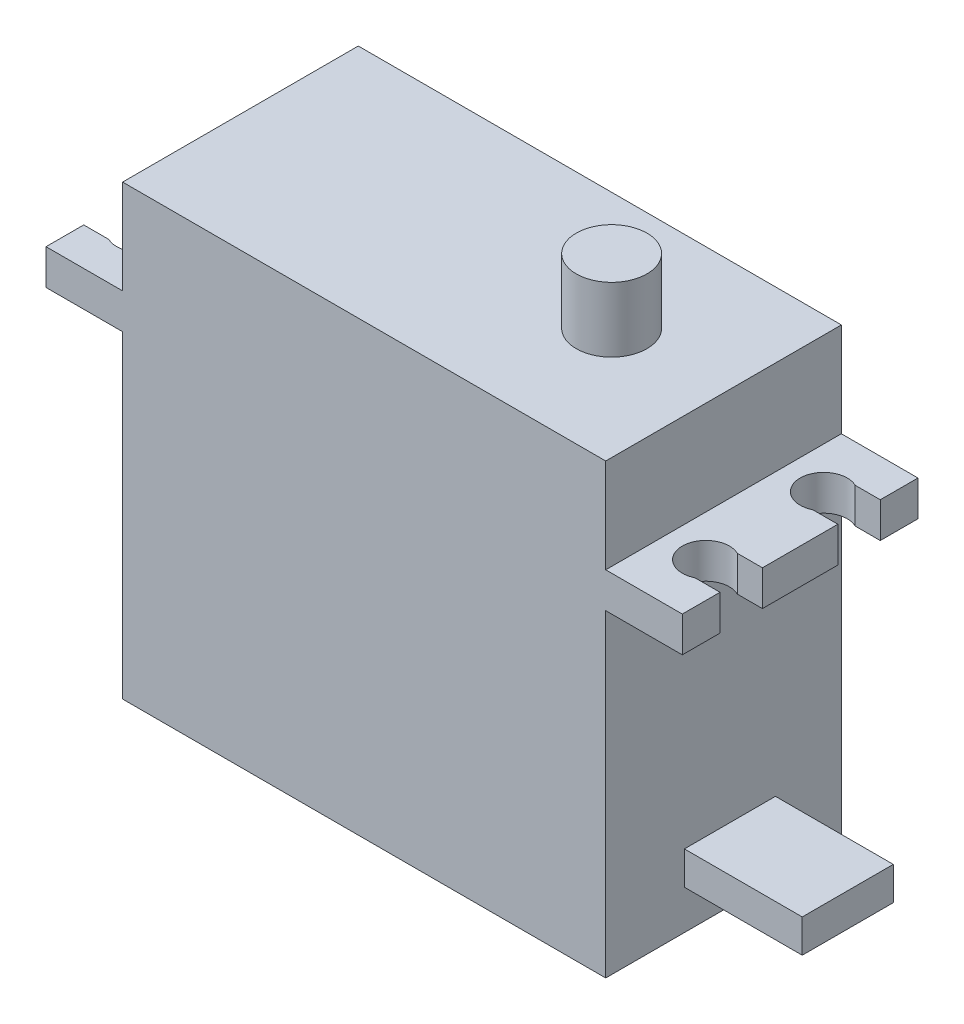
ISO-10303-21;
HEADER;
FILE_DESCRIPTION(('STEP AP214'),'2;1');
FILE_NAME('part.step','',(''),(''),'','','');
FILE_SCHEMA(('AUTOMOTIVE_DESIGN { 1 0 10303 214 1 1 1 1 }'));
ENDSEC;
DATA;
#1=APPLICATION_CONTEXT('core data for automotive mechanical design processes');
#2=APPLICATION_PROTOCOL_DEFINITION('international standard','automotive_design',2000,#1);
#3=PRODUCT_CONTEXT('',#1,'mechanical');
#4=PRODUCT('Part','Part','',(#3));
#5=PRODUCT_RELATED_PRODUCT_CATEGORY('part','',(#4));
#6=PRODUCT_DEFINITION_FORMATION('','',#4);
#7=PRODUCT_DEFINITION_CONTEXT('part definition',#1,'design');
#8=PRODUCT_DEFINITION('design','',#6,#7);
#9=PRODUCT_DEFINITION_SHAPE('','',#8);
#10=(LENGTH_UNIT() NAMED_UNIT(*) SI_UNIT(.MILLI.,.METRE.));
#11=(NAMED_UNIT(*) PLANE_ANGLE_UNIT() SI_UNIT($,.RADIAN.));
#12=(NAMED_UNIT(*) SI_UNIT($,.STERADIAN.) SOLID_ANGLE_UNIT());
#13=UNCERTAINTY_MEASURE_WITH_UNIT(LENGTH_MEASURE(1.E-05),#10,'distance_accuracy_value','');
#14=(GEOMETRIC_REPRESENTATION_CONTEXT(3) GLOBAL_UNCERTAINTY_ASSIGNED_CONTEXT((#13)) GLOBAL_UNIT_ASSIGNED_CONTEXT((#10,
#11,#12)) REPRESENTATION_CONTEXT('',''));
#15=CARTESIAN_POINT('',(0.,0.,0.));
#16=DIRECTION('',(0.,0.,1.));
#17=DIRECTION('',(1.,0.,0.));
#18=AXIS2_PLACEMENT_3D('',#15,#16,#17);
#19=CARTESIAN_POINT('',(20.5,38.,-10.));
#20=DIRECTION('',(-1.,0.,0.));
#21=DIRECTION('',(0.,0.,1.));
#22=AXIS2_PLACEMENT_3D('',#19,#20,#21);
#23=PLANE('',#22);
#24=DIRECTION('',(0.,-1.,0.));
#25=VECTOR('',#24,1.);
#26=CARTESIAN_POINT('',(20.5,38.,-10.));
#27=LINE('',#26,#25);
#28=CARTESIAN_POINT('',(20.5,27.,-10.));
#29=VERTEX_POINT('',#28);
#30=CARTESIAN_POINT('',(20.5,0.,-10.));
#31=VERTEX_POINT('',#30);
#32=EDGE_CURVE('E460',#29,#31,#27,.T.);
#33=ORIENTED_EDGE('',*,*,#32,.F.);
#34=DIRECTION('',(0.,0.,1.));
#35=VECTOR('',#34,1.);
#36=CARTESIAN_POINT('',(20.5,27.,-10.));
#37=LINE('',#36,#35);
#38=CARTESIAN_POINT('',(20.5,27.,10.));
#39=VERTEX_POINT('',#38);
#40=EDGE_CURVE('E425',#29,#39,#37,.T.);
#41=ORIENTED_EDGE('',*,*,#40,.T.);
#42=DIRECTION('',(0.,-1.,0.));
#43=VECTOR('',#42,1.);
#44=CARTESIAN_POINT('',(20.5,38.,10.));
#45=LINE('',#44,#43);
#46=CARTESIAN_POINT('',(20.5,0.,10.));
#47=VERTEX_POINT('',#46);
#48=EDGE_CURVE('E463',#39,#47,#45,.T.);
#49=ORIENTED_EDGE('',*,*,#48,.T.);
#50=DIRECTION('',(0.,0.,-1.));
#51=VECTOR('',#50,1.);
#52=CARTESIAN_POINT('',(20.5,0.,-10.));
#53=LINE('',#52,#51);
#54=EDGE_CURVE('E452',#47,#31,#53,.T.);
#55=ORIENTED_EDGE('',*,*,#54,.T.);
#56=EDGE_LOOP('',(#33,#41,#49,#55));
#57=FACE_BOUND('',#56,.T.);
#58=DIRECTION('',(0.,-1.,0.));
#59=VECTOR('',#58,1.);
#60=CARTESIAN_POINT('',(20.5,6.14900219854572,3.32183324877389));
#61=LINE('',#60,#59);
#62=CARTESIAN_POINT('',(20.5,6.14900219854572,3.32183324877389));
#63=VERTEX_POINT('',#62);
#64=CARTESIAN_POINT('',(20.5,3.33266531371568,3.32183324877389));
#65=VERTEX_POINT('',#64);
#66=EDGE_CURVE('E263',#63,#65,#61,.T.);
#67=ORIENTED_EDGE('',*,*,#66,.F.);
#68=DIRECTION('',(0.,0.,1.));
#69=VECTOR('',#68,1.);
#70=CARTESIAN_POINT('',(20.5,6.14900219854572,3.32183324877389));
#71=LINE('',#70,#69);
#72=CARTESIAN_POINT('',(20.5,6.14900219854572,-4.40503974293929));
#73=VERTEX_POINT('',#72);
#74=EDGE_CURVE('E260',#73,#63,#71,.T.);
#75=ORIENTED_EDGE('',*,*,#74,.F.);
#76=DIRECTION('',(0.,1.,0.));
#77=VECTOR('',#76,1.);
#78=CARTESIAN_POINT('',(20.5,6.14900219854572,-4.40503974293929));
#79=LINE('',#78,#77);
#80=CARTESIAN_POINT('',(20.5,3.33266531371569,-4.40503974293929));
#81=VERTEX_POINT('',#80);
#82=EDGE_CURVE('E54',#81,#73,#79,.T.);
#83=ORIENTED_EDGE('',*,*,#82,.F.);
#84=DIRECTION('',(0.,0.,-1.));
#85=VECTOR('',#84,1.);
#86=CARTESIAN_POINT('',(20.5,3.33266531371569,3.32183324877389));
#87=LINE('',#86,#85);
#88=EDGE_CURVE('E49',#65,#81,#87,.T.);
#89=ORIENTED_EDGE('',*,*,#88,.F.);
#90=EDGE_LOOP('',(#67,#75,#83,#89));
#91=FACE_BOUND('',#90,.T.);
#92=ADVANCED_FACE('F34',(#57,#91),#23,.F.);
#93=CARTESIAN_POINT('',(-20.5,38.,10.));
#94=DIRECTION('',(0.,1.,0.));
#95=DIRECTION('',(0.,0.,1.));
#96=AXIS2_PLACEMENT_3D('',#93,#94,#95);
#97=PLANE('',#96);
#98=DIRECTION('',(0.,0.,1.));
#99=VECTOR('',#98,1.);
#100=CARTESIAN_POINT('',(-20.5,38.,-10.));
#101=LINE('',#100,#99);
#102=CARTESIAN_POINT('',(-20.5,38.,-10.));
#103=VERTEX_POINT('',#102);
#104=CARTESIAN_POINT('',(-20.5,38.,10.));
#105=VERTEX_POINT('',#104);
#106=EDGE_CURVE('E436',#103,#105,#101,.T.);
#107=ORIENTED_EDGE('',*,*,#106,.T.);
#108=DIRECTION('',(1.,0.,0.));
#109=VECTOR('',#108,1.);
#110=CARTESIAN_POINT('',(-20.5,38.,10.));
#111=LINE('',#110,#109);
#112=CARTESIAN_POINT('',(20.5,38.,10.));
#113=VERTEX_POINT('',#112);
#114=EDGE_CURVE('E439',#105,#113,#111,.T.);
#115=ORIENTED_EDGE('',*,*,#114,.T.);
#116=DIRECTION('',(0.,0.,-1.));
#117=VECTOR('',#116,1.);
#118=CARTESIAN_POINT('',(20.5,38.,-10.));
#119=LINE('',#118,#117);
#120=CARTESIAN_POINT('',(20.5,38.,-10.));
#121=VERTEX_POINT('',#120);
#122=EDGE_CURVE('E442',#113,#121,#119,.T.);
#123=ORIENTED_EDGE('',*,*,#122,.T.);
#124=DIRECTION('',(-1.,0.,0.));
#125=VECTOR('',#124,1.);
#126=CARTESIAN_POINT('',(-20.5,38.,-10.));
#127=LINE('',#126,#125);
#128=EDGE_CURVE('E444',#121,#103,#127,.T.);
#129=ORIENTED_EDGE('',*,*,#128,.T.);
#130=EDGE_LOOP('',(#107,#115,#123,#129));
#131=FACE_BOUND('',#130,.T.);
#132=CARTESIAN_POINT('',(11.,38.,0.));
#133=DIRECTION('',(0.,1.,0.));
#134=DIRECTION('',(0.,0.,1.));
#135=AXIS2_PLACEMENT_3D('',#132,#133,#134);
#136=CIRCLE('',#135,3.);
#137=CARTESIAN_POINT('',(11.,38.,3.));
#138=VERTEX_POINT('',#137);
#139=EDGE_CURVE('E264',#138,#138,#136,.T.);
#140=ORIENTED_EDGE('',*,*,#139,.F.);
#141=EDGE_LOOP('',(#140));
#142=FACE_BOUND('',#141,.T.);
#143=ADVANCED_FACE('F506',(#131,#142),#97,.T.);
#144=CARTESIAN_POINT('',(-27.,30.,-10.));
#145=DIRECTION('',(1.,0.,0.));
#146=DIRECTION('',(0.,0.,-1.));
#147=AXIS2_PLACEMENT_3D('',#144,#145,#146);
#148=PLANE('',#147);
#149=DIRECTION('',(0.,0.,1.));
#150=VECTOR('',#149,1.);
#151=CARTESIAN_POINT('',(-27.,27.,-10.));
#152=LINE('',#151,#150);
#153=CARTESIAN_POINT('',(-27.,27.,-3.2));
#154=VERTEX_POINT('',#153);
#155=CARTESIAN_POINT('',(-27.,27.,3.2));
#156=VERTEX_POINT('',#155);
#157=EDGE_CURVE('E410',#154,#156,#152,.T.);
#158=ORIENTED_EDGE('',*,*,#157,.T.);
#159=DIRECTION('',(0.,1.,0.));
#160=VECTOR('',#159,1.);
#161=CARTESIAN_POINT('',(-27.,-0.001000000000001,3.2));
#162=LINE('',#161,#160);
#163=CARTESIAN_POINT('',(-27.,30.,3.2));
#164=VERTEX_POINT('',#163);
#165=EDGE_CURVE('E290',#156,#164,#162,.T.);
#166=ORIENTED_EDGE('',*,*,#165,.T.);
#167=DIRECTION('',(0.,0.,1.));
#168=VECTOR('',#167,1.);
#169=CARTESIAN_POINT('',(-27.,30.,-10.));
#170=LINE('',#169,#168);
#171=CARTESIAN_POINT('',(-27.,30.,-3.2));
#172=VERTEX_POINT('',#171);
#173=EDGE_CURVE('E393',#172,#164,#170,.T.);
#174=ORIENTED_EDGE('',*,*,#173,.F.);
#175=DIRECTION('',(0.,1.,0.));
#176=VECTOR('',#175,1.);
#177=CARTESIAN_POINT('',(-27.,-0.001000000000001,-3.2));
#178=LINE('',#177,#176);
#179=EDGE_CURVE('E319',#154,#172,#178,.T.);
#180=ORIENTED_EDGE('',*,*,#179,.F.);
#181=EDGE_LOOP('',(#158,#166,#174,#180));
#182=FACE_BOUND('',#181,.T.);
#183=ADVANCED_FACE('F533',(#182),#148,.F.);
#184=CARTESIAN_POINT('',(-27.,30.,6.80000000000001));
#185=VERTEX_POINT('',#184);
#186=CARTESIAN_POINT('',(-27.,30.,10.));
#187=VERTEX_POINT('',#186);
#188=EDGE_CURVE('E388',#185,#187,#170,.T.);
#189=ORIENTED_EDGE('',*,*,#188,.F.);
#190=DIRECTION('',(0.,1.,0.));
#191=VECTOR('',#190,1.);
#192=CARTESIAN_POINT('',(-27.,-0.001000000000001,6.80000000000001));
#193=LINE('',#192,#191);
#194=CARTESIAN_POINT('',(-27.,27.,6.80000000000001));
#195=VERTEX_POINT('',#194);
#196=EDGE_CURVE('E289',#195,#185,#193,.T.);
#197=ORIENTED_EDGE('',*,*,#196,.F.);
#198=CARTESIAN_POINT('',(-27.,27.,10.));
#199=VERTEX_POINT('',#198);
#200=EDGE_CURVE('E405',#195,#199,#152,.T.);
#201=ORIENTED_EDGE('',*,*,#200,.T.);
#202=DIRECTION('',(0.,-1.,0.));
#203=VECTOR('',#202,1.);
#204=CARTESIAN_POINT('',(-27.,30.,10.));
#205=LINE('',#204,#203);
#206=EDGE_CURVE('E416',#187,#199,#205,.T.);
#207=ORIENTED_EDGE('',*,*,#206,.F.);
#208=EDGE_LOOP('',(#189,#197,#201,#207));
#209=FACE_BOUND('',#208,.T.);
#210=ADVANCED_FACE('F526',(#209),#148,.F.);
#211=CARTESIAN_POINT('',(27.,30.,-10.));
#212=DIRECTION('',(-1.,0.,0.));
#213=DIRECTION('',(0.,0.,1.));
#214=AXIS2_PLACEMENT_3D('',#211,#212,#213);
#215=PLANE('',#214);
#216=DIRECTION('',(0.,0.,-1.));
#217=VECTOR('',#216,1.);
#218=CARTESIAN_POINT('',(27.,30.,-10.));
#219=LINE('',#218,#217);
#220=CARTESIAN_POINT('',(27.,30.,-6.8));
#221=VERTEX_POINT('',#220);
#222=CARTESIAN_POINT('',(27.,30.,-10.));
#223=VERTEX_POINT('',#222);
#224=EDGE_CURVE('E385',#221,#223,#219,.T.);
#225=ORIENTED_EDGE('',*,*,#224,.F.);
#226=DIRECTION('',(0.,1.,0.));
#227=VECTOR('',#226,1.);
#228=CARTESIAN_POINT('',(27.,-0.001000000000001,-6.8));
#229=LINE('',#228,#227);
#230=CARTESIAN_POINT('',(27.,27.,-6.8));
#231=VERTEX_POINT('',#230);
#232=EDGE_CURVE('E344',#231,#221,#229,.T.);
#233=ORIENTED_EDGE('',*,*,#232,.F.);
#234=DIRECTION('',(0.,0.,-1.));
#235=VECTOR('',#234,1.);
#236=CARTESIAN_POINT('',(27.,27.,-10.));
#237=LINE('',#236,#235);
#238=CARTESIAN_POINT('',(27.,27.,-10.));
#239=VERTEX_POINT('',#238);
#240=EDGE_CURVE('E379',#231,#239,#237,.T.);
#241=ORIENTED_EDGE('',*,*,#240,.T.);
#242=DIRECTION('',(0.,-1.,0.));
#243=VECTOR('',#242,1.);
#244=CARTESIAN_POINT('',(27.,30.,-10.));
#245=LINE('',#244,#243);
#246=EDGE_CURVE('E422',#223,#239,#245,.T.);
#247=ORIENTED_EDGE('',*,*,#246,.F.);
#248=EDGE_LOOP('',(#225,#233,#241,#247));
#249=FACE_BOUND('',#248,.T.);
#250=ADVANCED_FACE('F580',(#249),#215,.F.);
#251=CARTESIAN_POINT('',(27.,27.,10.));
#252=VERTEX_POINT('',#251);
#253=CARTESIAN_POINT('',(27.,27.,6.8));
#254=VERTEX_POINT('',#253);
#255=EDGE_CURVE('E397',#252,#254,#237,.T.);
#256=ORIENTED_EDGE('',*,*,#255,.T.);
#257=DIRECTION('',(0.,1.,0.));
#258=VECTOR('',#257,1.);
#259=CARTESIAN_POINT('',(27.,-0.001000000000001,6.8));
#260=LINE('',#259,#258);
#261=CARTESIAN_POINT('',(27.,30.,6.8));
#262=VERTEX_POINT('',#261);
#263=EDGE_CURVE('E368',#254,#262,#260,.T.);
#264=ORIENTED_EDGE('',*,*,#263,.T.);
#265=CARTESIAN_POINT('',(27.,30.,10.));
#266=VERTEX_POINT('',#265);
#267=EDGE_CURVE('E380',#266,#262,#219,.T.);
#268=ORIENTED_EDGE('',*,*,#267,.F.);
#269=DIRECTION('',(0.,-1.,0.));
#270=VECTOR('',#269,1.);
#271=CARTESIAN_POINT('',(27.,30.,10.));
#272=LINE('',#271,#270);
#273=EDGE_CURVE('E396',#266,#252,#272,.T.);
#274=ORIENTED_EDGE('',*,*,#273,.T.);
#275=EDGE_LOOP('',(#256,#264,#268,#274));
#276=FACE_BOUND('',#275,.T.);
#277=ADVANCED_FACE('F496',(#276),#215,.F.);
#278=CARTESIAN_POINT('',(-20.5,38.,-10.));
#279=DIRECTION('',(1.,0.,0.));
#280=DIRECTION('',(0.,0.,-1.));
#281=AXIS2_PLACEMENT_3D('',#278,#279,#280);
#282=PLANE('',#281);
#283=DIRECTION('',(0.,0.,-1.));
#284=VECTOR('',#283,1.);
#285=CARTESIAN_POINT('',(-20.5,30.,-10.));
#286=LINE('',#285,#284);
#287=CARTESIAN_POINT('',(-20.5,30.,10.));
#288=VERTEX_POINT('',#287);
#289=CARTESIAN_POINT('',(-20.5,30.,-10.));
#290=VERTEX_POINT('',#289);
#291=EDGE_CURVE('E433',#288,#290,#286,.T.);
#292=ORIENTED_EDGE('',*,*,#291,.F.);
#293=DIRECTION('',(0.,-1.,0.));
#294=VECTOR('',#293,1.);
#295=CARTESIAN_POINT('',(-20.5,38.,10.));
#296=LINE('',#295,#294);
#297=EDGE_CURVE('E11',#105,#288,#296,.T.);
#298=ORIENTED_EDGE('',*,*,#297,.F.);
#299=ORIENTED_EDGE('',*,*,#106,.F.);
#300=DIRECTION('',(0.,-1.,0.));
#301=VECTOR('',#300,1.);
#302=CARTESIAN_POINT('',(-20.5,38.,-10.));
#303=LINE('',#302,#301);
#304=EDGE_CURVE('E457',#103,#290,#303,.T.);
#305=ORIENTED_EDGE('',*,*,#304,.T.);
#306=EDGE_LOOP('',(#292,#298,#299,#305));
#307=FACE_BOUND('',#306,.T.);
#308=ADVANCED_FACE('F513',(#307),#282,.F.);
#309=DIRECTION('',(0.,0.,1.));
#310=VECTOR('',#309,1.);
#311=CARTESIAN_POINT('',(20.5,30.,-10.));
#312=LINE('',#311,#310);
#313=CARTESIAN_POINT('',(20.5,30.,-10.));
#314=VERTEX_POINT('',#313);
#315=CARTESIAN_POINT('',(20.5,30.,10.));
#316=VERTEX_POINT('',#315);
#317=EDGE_CURVE('E431',#314,#316,#312,.T.);
#318=ORIENTED_EDGE('',*,*,#317,.F.);
#319=EDGE_CURVE('E461',#121,#314,#27,.T.);
#320=ORIENTED_EDGE('',*,*,#319,.F.);
#321=ORIENTED_EDGE('',*,*,#122,.F.);
#322=EDGE_CURVE('E464',#113,#316,#45,.T.);
#323=ORIENTED_EDGE('',*,*,#322,.T.);
#324=EDGE_LOOP('',(#318,#320,#321,#323));
#325=FACE_BOUND('',#324,.T.);
#326=ADVANCED_FACE('F503',(#325),#23,.F.);
#327=CARTESIAN_POINT('',(-20.5,27.,10.));
#328=VERTEX_POINT('',#327);
#329=CARTESIAN_POINT('',(-20.5,0.,10.));
#330=VERTEX_POINT('',#329);
#331=EDGE_CURVE('E42',#328,#330,#296,.T.);
#332=ORIENTED_EDGE('',*,*,#331,.F.);
#333=DIRECTION('',(0.,0.,-1.));
#334=VECTOR('',#333,1.);
#335=CARTESIAN_POINT('',(-20.5,27.,-10.));
#336=LINE('',#335,#334);
#337=CARTESIAN_POINT('',(-20.5,27.,-10.));
#338=VERTEX_POINT('',#337);
#339=EDGE_CURVE('E428',#328,#338,#336,.T.);
#340=ORIENTED_EDGE('',*,*,#339,.T.);
#341=CARTESIAN_POINT('',(-20.5,0.,-10.));
#342=VERTEX_POINT('',#341);
#343=EDGE_CURVE('E446',#338,#342,#303,.T.);
#344=ORIENTED_EDGE('',*,*,#343,.T.);
#345=DIRECTION('',(0.,0.,1.));
#346=VECTOR('',#345,1.);
#347=CARTESIAN_POINT('',(-20.5,0.,-10.));
#348=LINE('',#347,#346);
#349=EDGE_CURVE('E435',#342,#330,#348,.T.);
#350=ORIENTED_EDGE('',*,*,#349,.T.);
#351=EDGE_LOOP('',(#332,#340,#344,#350));
#352=FACE_BOUND('',#351,.T.);
#353=ADVANCED_FACE('F36',(#352),#282,.F.);
#354=CARTESIAN_POINT('',(-20.5,38.,10.));
#355=DIRECTION('',(0.,0.,-1.));
#356=DIRECTION('',(-1.,0.,0.));
#357=AXIS2_PLACEMENT_3D('',#354,#355,#356);
#358=PLANE('',#357);
#359=ORIENTED_EDGE('',*,*,#48,.F.);
#360=DIRECTION('',(1.,0.,0.));
#361=VECTOR('',#360,1.);
#362=CARTESIAN_POINT('',(27.,27.,10.));
#363=LINE('',#362,#361);
#364=EDGE_CURVE('E409',#39,#252,#363,.T.);
#365=ORIENTED_EDGE('',*,*,#364,.T.);
#366=ORIENTED_EDGE('',*,*,#273,.F.);
#367=DIRECTION('',(1.,0.,0.));
#368=VECTOR('',#367,1.);
#369=CARTESIAN_POINT('',(27.,30.,10.));
#370=LINE('',#369,#368);
#371=EDGE_CURVE('E392',#316,#266,#370,.T.);
#372=ORIENTED_EDGE('',*,*,#371,.F.);
#373=ORIENTED_EDGE('',*,*,#322,.F.);
#374=ORIENTED_EDGE('',*,*,#114,.F.);
#375=ORIENTED_EDGE('',*,*,#297,.T.);
#376=EDGE_CURVE('E394',#187,#288,#370,.T.);
#377=ORIENTED_EDGE('',*,*,#376,.F.);
#378=ORIENTED_EDGE('',*,*,#206,.T.);
#379=EDGE_CURVE('E411',#199,#328,#363,.T.);
#380=ORIENTED_EDGE('',*,*,#379,.T.);
#381=ORIENTED_EDGE('',*,*,#331,.T.);
#382=DIRECTION('',(1.,0.,0.));
#383=VECTOR('',#382,1.);
#384=CARTESIAN_POINT('',(-20.5,0.,10.));
#385=LINE('',#384,#383);
#386=EDGE_CURVE('E449',#330,#47,#385,.T.);
#387=ORIENTED_EDGE('',*,*,#386,.T.);
#388=EDGE_LOOP('',(#359,#365,#366,#372,#373,#374,#375,#377,#378,#380,#381,#387));
#389=FACE_BOUND('',#388,.T.);
#390=ADVANCED_FACE('F477',(#389),#358,.F.);
#391=CARTESIAN_POINT('',(-20.5,38.,-10.));
#392=DIRECTION('',(0.,0.,1.));
#393=DIRECTION('',(1.,0.,0.));
#394=AXIS2_PLACEMENT_3D('',#391,#392,#393);
#395=PLANE('',#394);
#396=ORIENTED_EDGE('',*,*,#343,.F.);
#397=DIRECTION('',(-1.,0.,0.));
#398=VECTOR('',#397,1.);
#399=CARTESIAN_POINT('',(27.,27.,-10.));
#400=LINE('',#399,#398);
#401=CARTESIAN_POINT('',(-27.,27.,-10.));
#402=VERTEX_POINT('',#401);
#403=EDGE_CURVE('E400',#338,#402,#400,.T.);
#404=ORIENTED_EDGE('',*,*,#403,.T.);
#405=DIRECTION('',(0.,-1.,0.));
#406=VECTOR('',#405,1.);
#407=CARTESIAN_POINT('',(-27.,30.,-10.));
#408=LINE('',#407,#406);
#409=CARTESIAN_POINT('',(-27.,30.,-10.));
#410=VERTEX_POINT('',#409);
#411=EDGE_CURVE('E419',#410,#402,#408,.T.);
#412=ORIENTED_EDGE('',*,*,#411,.F.);
#413=DIRECTION('',(-1.,0.,0.));
#414=VECTOR('',#413,1.);
#415=CARTESIAN_POINT('',(27.,30.,-10.));
#416=LINE('',#415,#414);
#417=EDGE_CURVE('E383',#290,#410,#416,.T.);
#418=ORIENTED_EDGE('',*,*,#417,.F.);
#419=ORIENTED_EDGE('',*,*,#304,.F.);
#420=ORIENTED_EDGE('',*,*,#128,.F.);
#421=ORIENTED_EDGE('',*,*,#319,.T.);
#422=EDGE_CURVE('E386',#223,#314,#416,.T.);
#423=ORIENTED_EDGE('',*,*,#422,.F.);
#424=ORIENTED_EDGE('',*,*,#246,.T.);
#425=EDGE_CURVE('E402',#239,#29,#400,.T.);
#426=ORIENTED_EDGE('',*,*,#425,.T.);
#427=ORIENTED_EDGE('',*,*,#32,.T.);
#428=DIRECTION('',(-1.,0.,0.));
#429=VECTOR('',#428,1.);
#430=CARTESIAN_POINT('',(-20.5,0.,-10.));
#431=LINE('',#430,#429);
#432=EDGE_CURVE('E440',#31,#342,#431,.T.);
#433=ORIENTED_EDGE('',*,*,#432,.T.);
#434=EDGE_LOOP('',(#396,#404,#412,#418,#419,#420,#421,#423,#424,#426,#427,#433));
#435=FACE_BOUND('',#434,.T.);
#436=ADVANCED_FACE('F484',(#435),#395,.F.);
#437=CARTESIAN_POINT('',(-20.5,0.,10.));
#438=DIRECTION('',(0.,1.,0.));
#439=DIRECTION('',(0.,0.,1.));
#440=AXIS2_PLACEMENT_3D('',#437,#438,#439);
#441=PLANE('',#440);
#442=ORIENTED_EDGE('',*,*,#349,.F.);
#443=ORIENTED_EDGE('',*,*,#432,.F.);
#444=ORIENTED_EDGE('',*,*,#54,.F.);
#445=ORIENTED_EDGE('',*,*,#386,.F.);
#446=EDGE_LOOP('',(#442,#443,#444,#445));
#447=FACE_BOUND('',#446,.T.);
#448=ADVANCED_FACE('F481',(#447),#441,.F.);
#449=CARTESIAN_POINT('',(27.,27.,3.2));
#450=VERTEX_POINT('',#449);
#451=CARTESIAN_POINT('',(27.,27.,-3.2));
#452=VERTEX_POINT('',#451);
#453=EDGE_CURVE('E401',#450,#452,#237,.T.);
#454=ORIENTED_EDGE('',*,*,#453,.T.);
#455=DIRECTION('',(0.,1.,0.));
#456=VECTOR('',#455,1.);
#457=CARTESIAN_POINT('',(27.,-0.001000000000001,-3.2));
#458=LINE('',#457,#456);
#459=CARTESIAN_POINT('',(27.,30.,-3.2));
#460=VERTEX_POINT('',#459);
#461=EDGE_CURVE('E346',#452,#460,#458,.T.);
#462=ORIENTED_EDGE('',*,*,#461,.T.);
#463=CARTESIAN_POINT('',(27.,30.,3.2));
#464=VERTEX_POINT('',#463);
#465=EDGE_CURVE('E384',#464,#460,#219,.T.);
#466=ORIENTED_EDGE('',*,*,#465,.F.);
#467=DIRECTION('',(0.,1.,0.));
#468=VECTOR('',#467,1.);
#469=CARTESIAN_POINT('',(27.,-0.001000000000001,3.2));
#470=LINE('',#469,#468);
#471=EDGE_CURVE('E367',#450,#464,#470,.T.);
#472=ORIENTED_EDGE('',*,*,#471,.F.);
#473=EDGE_LOOP('',(#454,#462,#466,#472));
#474=FACE_BOUND('',#473,.T.);
#475=ADVANCED_FACE('F575',(#474),#215,.F.);
#476=CARTESIAN_POINT('',(27.,27.,10.));
#477=DIRECTION('',(0.,-1.,0.));
#478=DIRECTION('',(0.,0.,-1.));
#479=AXIS2_PLACEMENT_3D('',#476,#477,#478);
#480=PLANE('',#479);
#481=DIRECTION('',(-1.,0.,0.));
#482=VECTOR('',#481,1.);
#483=CARTESIAN_POINT('',(27.,27.,-6.8));
#484=LINE('',#483,#482);
#485=CARTESIAN_POINT('',(24.8717797887081,27.,-6.8));
#486=VERTEX_POINT('',#485);
#487=EDGE_CURVE('E330',#231,#486,#484,.T.);
#488=ORIENTED_EDGE('',*,*,#487,.T.);
#489=CARTESIAN_POINT('',(24.,27.,-5.));
#490=DIRECTION('',(0.,-1.,0.));
#491=DIRECTION('',(0.,0.,-1.));
#492=AXIS2_PLACEMENT_3D('',#489,#490,#491);
#493=CIRCLE('',#492,2.);
#494=CARTESIAN_POINT('',(24.8717797887081,27.,-3.2));
#495=VERTEX_POINT('',#494);
#496=EDGE_CURVE('E327',#486,#495,#493,.F.);
#497=ORIENTED_EDGE('',*,*,#496,.T.);
#498=DIRECTION('',(1.,0.,0.));
#499=VECTOR('',#498,1.);
#500=CARTESIAN_POINT('',(27.,27.,-3.2));
#501=LINE('',#500,#499);
#502=EDGE_CURVE('E343',#495,#452,#501,.T.);
#503=ORIENTED_EDGE('',*,*,#502,.T.);
#504=ORIENTED_EDGE('',*,*,#453,.F.);
#505=DIRECTION('',(-1.,0.,0.));
#506=VECTOR('',#505,1.);
#507=CARTESIAN_POINT('',(27.,27.,3.2));
#508=LINE('',#507,#506);
#509=CARTESIAN_POINT('',(24.8717797887081,27.,3.2));
#510=VERTEX_POINT('',#509);
#511=EDGE_CURVE('E371',#450,#510,#508,.T.);
#512=ORIENTED_EDGE('',*,*,#511,.T.);
#513=CARTESIAN_POINT('',(24.,27.,5.));
#514=DIRECTION('',(0.,-1.,0.));
#515=DIRECTION('',(0.,0.,-1.));
#516=AXIS2_PLACEMENT_3D('',#513,#514,#515);
#517=CIRCLE('',#516,2.);
#518=CARTESIAN_POINT('',(24.8717797887081,27.,6.8));
#519=VERTEX_POINT('',#518);
#520=EDGE_CURVE('E353',#510,#519,#517,.F.);
#521=ORIENTED_EDGE('',*,*,#520,.T.);
#522=DIRECTION('',(1.,0.,0.));
#523=VECTOR('',#522,1.);
#524=CARTESIAN_POINT('',(27.,27.,6.8));
#525=LINE('',#524,#523);
#526=EDGE_CURVE('E356',#519,#254,#525,.T.);
#527=ORIENTED_EDGE('',*,*,#526,.T.);
#528=ORIENTED_EDGE('',*,*,#255,.F.);
#529=ORIENTED_EDGE('',*,*,#364,.F.);
#530=ORIENTED_EDGE('',*,*,#40,.F.);
#531=ORIENTED_EDGE('',*,*,#425,.F.);
#532=ORIENTED_EDGE('',*,*,#240,.F.);
#533=EDGE_LOOP('',(#488,#497,#503,#504,#512,#521,#527,#528,#529,#530,#531,#532));
#534=FACE_BOUND('',#533,.T.);
#535=ADVANCED_FACE('F490',(#534),#480,.T.);
#536=CARTESIAN_POINT('',(27.,30.,10.));
#537=DIRECTION('',(0.,-1.,0.));
#538=DIRECTION('',(0.,0.,-1.));
#539=AXIS2_PLACEMENT_3D('',#536,#537,#538);
#540=PLANE('',#539);
#541=CARTESIAN_POINT('',(24.,30.,-5.));
#542=DIRECTION('',(0.,1.,0.));
#543=DIRECTION('',(0.,0.,-1.));
#544=AXIS2_PLACEMENT_3D('',#541,#542,#543);
#545=CIRCLE('',#544,2.);
#546=CARTESIAN_POINT('',(24.8717797887081,30.,-6.8));
#547=VERTEX_POINT('',#546);
#548=CARTESIAN_POINT('',(24.8717797887081,30.,-3.2));
#549=VERTEX_POINT('',#548);
#550=EDGE_CURVE('E333',#547,#549,#545,.T.);
#551=ORIENTED_EDGE('',*,*,#550,.F.);
#552=DIRECTION('',(-1.,0.,0.));
#553=VECTOR('',#552,1.);
#554=CARTESIAN_POINT('',(27.,30.,-6.8));
#555=LINE('',#554,#553);
#556=EDGE_CURVE('E337',#221,#547,#555,.T.);
#557=ORIENTED_EDGE('',*,*,#556,.F.);
#558=ORIENTED_EDGE('',*,*,#224,.T.);
#559=ORIENTED_EDGE('',*,*,#422,.T.);
#560=ORIENTED_EDGE('',*,*,#317,.T.);
#561=ORIENTED_EDGE('',*,*,#371,.T.);
#562=ORIENTED_EDGE('',*,*,#267,.T.);
#563=DIRECTION('',(1.,0.,0.));
#564=VECTOR('',#563,1.);
#565=CARTESIAN_POINT('',(27.,30.,6.8));
#566=LINE('',#565,#564);
#567=CARTESIAN_POINT('',(24.8717797887081,30.,6.8));
#568=VERTEX_POINT('',#567);
#569=EDGE_CURVE('E365',#568,#262,#566,.T.);
#570=ORIENTED_EDGE('',*,*,#569,.F.);
#571=CARTESIAN_POINT('',(24.,30.,5.));
#572=DIRECTION('',(0.,1.,0.));
#573=DIRECTION('',(0.,0.,1.));
#574=AXIS2_PLACEMENT_3D('',#571,#572,#573);
#575=CIRCLE('',#574,2.);
#576=CARTESIAN_POINT('',(24.8717797887081,30.,3.2));
#577=VERTEX_POINT('',#576);
#578=EDGE_CURVE('E362',#577,#568,#575,.T.);
#579=ORIENTED_EDGE('',*,*,#578,.F.);
#580=DIRECTION('',(-1.,0.,0.));
#581=VECTOR('',#580,1.);
#582=CARTESIAN_POINT('',(27.,30.,3.2));
#583=LINE('',#582,#581);
#584=EDGE_CURVE('E359',#464,#577,#583,.T.);
#585=ORIENTED_EDGE('',*,*,#584,.F.);
#586=ORIENTED_EDGE('',*,*,#465,.T.);
#587=DIRECTION('',(1.,0.,0.));
#588=VECTOR('',#587,1.);
#589=CARTESIAN_POINT('',(27.,30.,-3.2));
#590=LINE('',#589,#588);
#591=EDGE_CURVE('E335',#549,#460,#590,.T.);
#592=ORIENTED_EDGE('',*,*,#591,.F.);
#593=EDGE_LOOP('',(#551,#557,#558,#559,#560,#561,#562,#570,#579,#585,#586,#592));
#594=FACE_BOUND('',#593,.T.);
#595=ADVANCED_FACE('F500',(#594),#540,.F.);
#596=ORIENTED_EDGE('',*,*,#173,.T.);
#597=DIRECTION('',(-1.,0.,0.));
#598=VECTOR('',#597,1.);
#599=CARTESIAN_POINT('',(-27.,30.,3.2));
#600=LINE('',#599,#598);
#601=CARTESIAN_POINT('',(-24.8717797887081,30.,3.20000000000001));
#602=VERTEX_POINT('',#601);
#603=EDGE_CURVE('E287',#602,#164,#600,.T.);
#604=ORIENTED_EDGE('',*,*,#603,.F.);
#605=CARTESIAN_POINT('',(-24.,30.,5.));
#606=DIRECTION('',(0.,1.,0.));
#607=DIRECTION('',(0.,0.,-1.));
#608=AXIS2_PLACEMENT_3D('',#605,#606,#607);
#609=CIRCLE('',#608,1.99999999999999);
#610=CARTESIAN_POINT('',(-24.8717797887081,30.,6.8));
#611=VERTEX_POINT('',#610);
#612=EDGE_CURVE('E284',#611,#602,#609,.T.);
#613=ORIENTED_EDGE('',*,*,#612,.F.);
#614=DIRECTION('',(1.,0.,0.));
#615=VECTOR('',#614,1.);
#616=CARTESIAN_POINT('',(-27.,30.,6.80000000000001));
#617=LINE('',#616,#615);
#618=EDGE_CURVE('E281',#185,#611,#617,.T.);
#619=ORIENTED_EDGE('',*,*,#618,.F.);
#620=ORIENTED_EDGE('',*,*,#188,.T.);
#621=ORIENTED_EDGE('',*,*,#376,.T.);
#622=ORIENTED_EDGE('',*,*,#291,.T.);
#623=ORIENTED_EDGE('',*,*,#417,.T.);
#624=CARTESIAN_POINT('',(-27.,30.,-6.80000000000001));
#625=VERTEX_POINT('',#624);
#626=EDGE_CURVE('E389',#410,#625,#170,.T.);
#627=ORIENTED_EDGE('',*,*,#626,.T.);
#628=DIRECTION('',(-1.,0.,0.));
#629=VECTOR('',#628,1.);
#630=CARTESIAN_POINT('',(-27.,30.,-6.80000000000001));
#631=LINE('',#630,#629);
#632=CARTESIAN_POINT('',(-24.8717797887081,30.,-6.8));
#633=VERTEX_POINT('',#632);
#634=EDGE_CURVE('E310',#633,#625,#631,.T.);
#635=ORIENTED_EDGE('',*,*,#634,.F.);
#636=CARTESIAN_POINT('',(-24.,30.,-5.));
#637=DIRECTION('',(0.,1.,0.));
#638=DIRECTION('',(0.,0.,1.));
#639=AXIS2_PLACEMENT_3D('',#636,#637,#638);
#640=CIRCLE('',#639,1.99999999999999);
#641=CARTESIAN_POINT('',(-24.8717797887081,30.,-3.20000000000001));
#642=VERTEX_POINT('',#641);
#643=EDGE_CURVE('E307',#642,#633,#640,.T.);
#644=ORIENTED_EDGE('',*,*,#643,.F.);
#645=DIRECTION('',(1.,0.,0.));
#646=VECTOR('',#645,1.);
#647=CARTESIAN_POINT('',(-27.,30.,-3.2));
#648=LINE('',#647,#646);
#649=EDGE_CURVE('E312',#172,#642,#648,.T.);
#650=ORIENTED_EDGE('',*,*,#649,.F.);
#651=EDGE_LOOP('',(#596,#604,#613,#619,#620,#621,#622,#623,#627,#635,#644,#650));
#652=FACE_BOUND('',#651,.T.);
#653=ADVANCED_FACE('F519',(#652),#540,.F.);
#654=DIRECTION('',(-1.,0.,0.));
#655=VECTOR('',#654,1.);
#656=CARTESIAN_POINT('',(-27.,27.,3.2));
#657=LINE('',#656,#655);
#658=CARTESIAN_POINT('',(-24.8717797887081,27.,3.20000000000001));
#659=VERTEX_POINT('',#658);
#660=EDGE_CURVE('E278',#659,#156,#657,.T.);
#661=ORIENTED_EDGE('',*,*,#660,.T.);
#662=ORIENTED_EDGE('',*,*,#157,.F.);
#663=DIRECTION('',(1.,0.,0.));
#664=VECTOR('',#663,1.);
#665=CARTESIAN_POINT('',(-27.,27.,-3.2));
#666=LINE('',#665,#664);
#667=CARTESIAN_POINT('',(-24.8717797887081,27.,-3.20000000000001));
#668=VERTEX_POINT('',#667);
#669=EDGE_CURVE('E304',#154,#668,#666,.T.);
#670=ORIENTED_EDGE('',*,*,#669,.T.);
#671=CARTESIAN_POINT('',(-24.,27.,-5.));
#672=DIRECTION('',(0.,-1.,0.));
#673=DIRECTION('',(0.,0.,-1.));
#674=AXIS2_PLACEMENT_3D('',#671,#672,#673);
#675=CIRCLE('',#674,1.99999999999999);
#676=CARTESIAN_POINT('',(-24.8717797887081,27.,-6.8));
#677=VERTEX_POINT('',#676);
#678=EDGE_CURVE('E301',#668,#677,#675,.F.);
#679=ORIENTED_EDGE('',*,*,#678,.T.);
#680=DIRECTION('',(-1.,0.,0.));
#681=VECTOR('',#680,1.);
#682=CARTESIAN_POINT('',(-27.,27.,-6.80000000000001));
#683=LINE('',#682,#681);
#684=CARTESIAN_POINT('',(-27.,27.,-6.80000000000001));
#685=VERTEX_POINT('',#684);
#686=EDGE_CURVE('E318',#677,#685,#683,.T.);
#687=ORIENTED_EDGE('',*,*,#686,.T.);
#688=EDGE_CURVE('E406',#402,#685,#152,.T.);
#689=ORIENTED_EDGE('',*,*,#688,.F.);
#690=ORIENTED_EDGE('',*,*,#403,.F.);
#691=ORIENTED_EDGE('',*,*,#339,.F.);
#692=ORIENTED_EDGE('',*,*,#379,.F.);
#693=ORIENTED_EDGE('',*,*,#200,.F.);
#694=DIRECTION('',(1.,0.,0.));
#695=VECTOR('',#694,1.);
#696=CARTESIAN_POINT('',(-27.,27.,6.80000000000001));
#697=LINE('',#696,#695);
#698=CARTESIAN_POINT('',(-24.8717797887081,27.,6.8));
#699=VERTEX_POINT('',#698);
#700=EDGE_CURVE('E293',#195,#699,#697,.T.);
#701=ORIENTED_EDGE('',*,*,#700,.T.);
#702=CARTESIAN_POINT('',(-24.,27.,5.));
#703=DIRECTION('',(0.,-1.,0.));
#704=DIRECTION('',(0.,0.,-1.));
#705=AXIS2_PLACEMENT_3D('',#702,#703,#704);
#706=CIRCLE('',#705,1.99999999999999);
#707=EDGE_CURVE('E274',#699,#659,#706,.F.);
#708=ORIENTED_EDGE('',*,*,#707,.T.);
#709=EDGE_LOOP('',(#661,#662,#670,#679,#687,#689,#690,#691,#692,#693,#701,#708));
#710=FACE_BOUND('',#709,.T.);
#711=ADVANCED_FACE('F535',(#710),#480,.T.);
#712=ORIENTED_EDGE('',*,*,#688,.T.);
#713=DIRECTION('',(0.,1.,0.));
#714=VECTOR('',#713,1.);
#715=CARTESIAN_POINT('',(-27.,-0.001000000000001,-6.80000000000001));
#716=LINE('',#715,#714);
#717=EDGE_CURVE('E321',#685,#625,#716,.T.);
#718=ORIENTED_EDGE('',*,*,#717,.T.);
#719=ORIENTED_EDGE('',*,*,#626,.F.);
#720=ORIENTED_EDGE('',*,*,#411,.T.);
#721=EDGE_LOOP('',(#712,#718,#719,#720));
#722=FACE_BOUND('',#721,.T.);
#723=ADVANCED_FACE('F555',(#722),#148,.F.);
#724=CARTESIAN_POINT('',(27.,-0.001000000000001,6.8));
#725=DIRECTION('',(0.,0.,1.));
#726=DIRECTION('',(1.,0.,0.));
#727=AXIS2_PLACEMENT_3D('',#724,#725,#726);
#728=PLANE('',#727);
#729=DIRECTION('',(0.,1.,0.));
#730=VECTOR('',#729,1.);
#731=CARTESIAN_POINT('',(24.8717797887081,-0.001000000000001,6.8));
#732=LINE('',#731,#730);
#733=EDGE_CURVE('E372',#519,#568,#732,.T.);
#734=ORIENTED_EDGE('',*,*,#733,.T.);
#735=ORIENTED_EDGE('',*,*,#569,.T.);
#736=ORIENTED_EDGE('',*,*,#263,.F.);
#737=ORIENTED_EDGE('',*,*,#526,.F.);
#738=EDGE_LOOP('',(#734,#735,#736,#737));
#739=FACE_BOUND('',#738,.T.);
#740=ADVANCED_FACE('F583',(#739),#728,.F.);
#741=CARTESIAN_POINT('',(24.,-0.001000000000001,5.));
#742=DIRECTION('',(0.,1.,0.));
#743=DIRECTION('',(0.,0.,1.));
#744=AXIS2_PLACEMENT_3D('',#741,#742,#743);
#745=CYLINDRICAL_SURFACE('',#744,2.);
#746=DIRECTION('',(0.,1.,0.));
#747=VECTOR('',#746,1.);
#748=CARTESIAN_POINT('',(24.8717797887081,-0.001000000000001,3.2));
#749=LINE('',#748,#747);
#750=EDGE_CURVE('E374',#510,#577,#749,.T.);
#751=ORIENTED_EDGE('',*,*,#750,.T.);
#752=ORIENTED_EDGE('',*,*,#578,.T.);
#753=ORIENTED_EDGE('',*,*,#733,.F.);
#754=ORIENTED_EDGE('',*,*,#520,.F.);
#755=EDGE_LOOP('',(#751,#752,#753,#754));
#756=FACE_BOUND('',#755,.T.);
#757=ADVANCED_FACE('F592',(#756),#745,.F.);
#758=CARTESIAN_POINT('',(27.,-0.001000000000001,3.2));
#759=DIRECTION('',(0.,0.,-1.));
#760=DIRECTION('',(-1.,0.,0.));
#761=AXIS2_PLACEMENT_3D('',#758,#759,#760);
#762=PLANE('',#761);
#763=ORIENTED_EDGE('',*,*,#471,.T.);
#764=ORIENTED_EDGE('',*,*,#584,.T.);
#765=ORIENTED_EDGE('',*,*,#750,.F.);
#766=ORIENTED_EDGE('',*,*,#511,.F.);
#767=EDGE_LOOP('',(#763,#764,#765,#766));
#768=FACE_BOUND('',#767,.T.);
#769=ADVANCED_FACE('F588',(#768),#762,.F.);
#770=CARTESIAN_POINT('',(24.,-0.001000000000001,-5.));
#771=DIRECTION('',(0.,1.,0.));
#772=DIRECTION('',(0.,0.,1.));
#773=AXIS2_PLACEMENT_3D('',#770,#771,#772);
#774=CYLINDRICAL_SURFACE('',#773,2.);
#775=DIRECTION('',(0.,1.,0.));
#776=VECTOR('',#775,1.);
#777=CARTESIAN_POINT('',(24.8717797887081,-0.001000000000001,-6.8));
#778=LINE('',#777,#776);
#779=EDGE_CURVE('E341',#486,#547,#778,.T.);
#780=ORIENTED_EDGE('',*,*,#779,.T.);
#781=ORIENTED_EDGE('',*,*,#550,.T.);
#782=DIRECTION('',(0.,1.,0.));
#783=VECTOR('',#782,1.);
#784=CARTESIAN_POINT('',(24.8717797887081,-0.001000000000001,-3.2));
#785=LINE('',#784,#783);
#786=EDGE_CURVE('E340',#495,#549,#785,.T.);
#787=ORIENTED_EDGE('',*,*,#786,.F.);
#788=ORIENTED_EDGE('',*,*,#496,.F.);
#789=EDGE_LOOP('',(#780,#781,#787,#788));
#790=FACE_BOUND('',#789,.T.);
#791=ADVANCED_FACE('F591',(#790),#774,.F.);
#792=CARTESIAN_POINT('',(27.,-0.001000000000001,-6.8));
#793=DIRECTION('',(0.,0.,-1.));
#794=DIRECTION('',(-1.,0.,0.));
#795=AXIS2_PLACEMENT_3D('',#792,#793,#794);
#796=PLANE('',#795);
#797=ORIENTED_EDGE('',*,*,#232,.T.);
#798=ORIENTED_EDGE('',*,*,#556,.T.);
#799=ORIENTED_EDGE('',*,*,#779,.F.);
#800=ORIENTED_EDGE('',*,*,#487,.F.);
#801=EDGE_LOOP('',(#797,#798,#799,#800));
#802=FACE_BOUND('',#801,.T.);
#803=ADVANCED_FACE('F602',(#802),#796,.F.);
#804=CARTESIAN_POINT('',(27.,-0.001000000000001,-3.2));
#805=DIRECTION('',(0.,0.,1.));
#806=DIRECTION('',(1.,0.,0.));
#807=AXIS2_PLACEMENT_3D('',#804,#805,#806);
#808=PLANE('',#807);
#809=ORIENTED_EDGE('',*,*,#786,.T.);
#810=ORIENTED_EDGE('',*,*,#591,.T.);
#811=ORIENTED_EDGE('',*,*,#461,.F.);
#812=ORIENTED_EDGE('',*,*,#502,.F.);
#813=EDGE_LOOP('',(#809,#810,#811,#812));
#814=FACE_BOUND('',#813,.T.);
#815=ADVANCED_FACE('F604',(#814),#808,.F.);
#816=CARTESIAN_POINT('',(-24.,-0.001000000000001,-5.));
#817=DIRECTION('',(0.,1.,0.));
#818=DIRECTION('',(0.,0.,1.));
#819=AXIS2_PLACEMENT_3D('',#816,#817,#818);
#820=CYLINDRICAL_SURFACE('',#819,1.99999999999999);
#821=DIRECTION('',(0.,1.,0.));
#822=VECTOR('',#821,1.);
#823=CARTESIAN_POINT('',(-24.8717797887081,-0.001000000000001,-3.20000000000001));
#824=LINE('',#823,#822);
#825=EDGE_CURVE('E316',#668,#642,#824,.T.);
#826=ORIENTED_EDGE('',*,*,#825,.T.);
#827=ORIENTED_EDGE('',*,*,#643,.T.);
#828=DIRECTION('',(0.,1.,0.));
#829=VECTOR('',#828,1.);
#830=CARTESIAN_POINT('',(-24.8717797887081,-0.001000000000001,-6.8));
#831=LINE('',#830,#829);
#832=EDGE_CURVE('E315',#677,#633,#831,.T.);
#833=ORIENTED_EDGE('',*,*,#832,.F.);
#834=ORIENTED_EDGE('',*,*,#678,.F.);
#835=EDGE_LOOP('',(#826,#827,#833,#834));
#836=FACE_BOUND('',#835,.T.);
#837=ADVANCED_FACE('F550',(#836),#820,.F.);
#838=CARTESIAN_POINT('',(-27.,-0.001000000000001,-3.2));
#839=DIRECTION('',(0.,0.,1.));
#840=DIRECTION('',(1.,0.,0.));
#841=AXIS2_PLACEMENT_3D('',#838,#839,#840);
#842=PLANE('',#841);
#843=ORIENTED_EDGE('',*,*,#179,.T.);
#844=ORIENTED_EDGE('',*,*,#649,.T.);
#845=ORIENTED_EDGE('',*,*,#825,.F.);
#846=ORIENTED_EDGE('',*,*,#669,.F.);
#847=EDGE_LOOP('',(#843,#844,#845,#846));
#848=FACE_BOUND('',#847,.T.);
#849=ADVANCED_FACE('F548',(#848),#842,.F.);
#850=CARTESIAN_POINT('',(-27.,-0.001000000000001,-6.80000000000001));
#851=DIRECTION('',(0.,0.,-1.));
#852=DIRECTION('',(-1.,0.,0.));
#853=AXIS2_PLACEMENT_3D('',#850,#851,#852);
#854=PLANE('',#853);
#855=ORIENTED_EDGE('',*,*,#832,.T.);
#856=ORIENTED_EDGE('',*,*,#634,.T.);
#857=ORIENTED_EDGE('',*,*,#717,.F.);
#858=ORIENTED_EDGE('',*,*,#686,.F.);
#859=EDGE_LOOP('',(#855,#856,#857,#858));
#860=FACE_BOUND('',#859,.T.);
#861=ADVANCED_FACE('F613',(#860),#854,.F.);
#862=CARTESIAN_POINT('',(-27.,-0.001000000000001,3.2));
#863=DIRECTION('',(0.,0.,-1.));
#864=DIRECTION('',(-1.,0.,0.));
#865=AXIS2_PLACEMENT_3D('',#862,#863,#864);
#866=PLANE('',#865);
#867=DIRECTION('',(0.,1.,0.));
#868=VECTOR('',#867,1.);
#869=CARTESIAN_POINT('',(-24.8717797887081,-0.001000000000001,3.20000000000001));
#870=LINE('',#869,#868);
#871=EDGE_CURVE('E294',#659,#602,#870,.T.);
#872=ORIENTED_EDGE('',*,*,#871,.T.);
#873=ORIENTED_EDGE('',*,*,#603,.T.);
#874=ORIENTED_EDGE('',*,*,#165,.F.);
#875=ORIENTED_EDGE('',*,*,#660,.F.);
#876=EDGE_LOOP('',(#872,#873,#874,#875));
#877=FACE_BOUND('',#876,.T.);
#878=ADVANCED_FACE('F539',(#877),#866,.F.);
#879=CARTESIAN_POINT('',(-24.,-0.001000000000001,5.));
#880=DIRECTION('',(0.,1.,0.));
#881=DIRECTION('',(0.,0.,1.));
#882=AXIS2_PLACEMENT_3D('',#879,#880,#881);
#883=CYLINDRICAL_SURFACE('',#882,1.99999999999999);
#884=DIRECTION('',(0.,1.,0.));
#885=VECTOR('',#884,1.);
#886=CARTESIAN_POINT('',(-24.8717797887081,-0.001000000000001,6.8));
#887=LINE('',#886,#885);
#888=EDGE_CURVE('E296',#699,#611,#887,.T.);
#889=ORIENTED_EDGE('',*,*,#888,.T.);
#890=ORIENTED_EDGE('',*,*,#612,.T.);
#891=ORIENTED_EDGE('',*,*,#871,.F.);
#892=ORIENTED_EDGE('',*,*,#707,.F.);
#893=EDGE_LOOP('',(#889,#890,#891,#892));
#894=FACE_BOUND('',#893,.T.);
#895=ADVANCED_FACE('F541',(#894),#883,.F.);
#896=CARTESIAN_POINT('',(-27.,-0.001000000000001,6.80000000000001));
#897=DIRECTION('',(0.,0.,1.));
#898=DIRECTION('',(1.,0.,0.));
#899=AXIS2_PLACEMENT_3D('',#896,#897,#898);
#900=PLANE('',#899);
#901=ORIENTED_EDGE('',*,*,#196,.T.);
#902=ORIENTED_EDGE('',*,*,#618,.T.);
#903=ORIENTED_EDGE('',*,*,#888,.F.);
#904=ORIENTED_EDGE('',*,*,#700,.F.);
#905=EDGE_LOOP('',(#901,#902,#903,#904));
#906=FACE_BOUND('',#905,.T.);
#907=ADVANCED_FACE('F618',(#906),#900,.F.);
#908=CARTESIAN_POINT('',(11.,43.5,0.));
#909=DIRECTION('',(0.,-1.,0.));
#910=DIRECTION('',(0.,0.,-1.));
#911=AXIS2_PLACEMENT_3D('',#908,#909,#910);
#912=CYLINDRICAL_SURFACE('',#911,3.);
#913=CARTESIAN_POINT('',(11.,43.5,0.));
#914=DIRECTION('',(0.,1.,0.));
#915=DIRECTION('',(0.,0.,1.));
#916=AXIS2_PLACEMENT_3D('',#913,#914,#915);
#917=CIRCLE('',#916,3.);
#918=CARTESIAN_POINT('',(11.,43.5,3.));
#919=VERTEX_POINT('',#918);
#920=EDGE_CURVE('E267',#919,#919,#917,.T.);
#921=ORIENTED_EDGE('',*,*,#920,.F.);
#922=EDGE_LOOP('',(#921));
#923=FACE_BOUND('',#922,.T.);
#924=ORIENTED_EDGE('',*,*,#139,.T.);
#925=EDGE_LOOP('',(#924));
#926=FACE_BOUND('',#925,.T.);
#927=ADVANCED_FACE('F621',(#923,#926),#912,.T.);
#928=CARTESIAN_POINT('',(11.,43.5,0.));
#929=DIRECTION('',(0.,1.,0.));
#930=DIRECTION('',(0.,0.,1.));
#931=AXIS2_PLACEMENT_3D('',#928,#929,#930);
#932=PLANE('',#931);
#933=ORIENTED_EDGE('',*,*,#920,.T.);
#934=EDGE_LOOP('',(#933));
#935=FACE_BOUND('',#934,.T.);
#936=ADVANCED_FACE('F629',(#935),#932,.T.);
#937=CARTESIAN_POINT('',(30.5,6.14900219854572,3.32183324877389));
#938=DIRECTION('',(0.,0.,-1.));
#939=DIRECTION('',(-1.,0.,0.));
#940=AXIS2_PLACEMENT_3D('',#937,#938,#939);
#941=PLANE('',#940);
#942=ORIENTED_EDGE('',*,*,#66,.T.);
#943=DIRECTION('',(-1.,0.,0.));
#944=VECTOR('',#943,1.);
#945=CARTESIAN_POINT('',(30.5,3.33266531371569,3.32183324877389));
#946=LINE('',#945,#944);
#947=CARTESIAN_POINT('',(30.5,3.33266531371569,3.32183324877389));
#948=VERTEX_POINT('',#947);
#949=EDGE_CURVE('E244',#948,#65,#946,.T.);
#950=ORIENTED_EDGE('',*,*,#949,.F.);
#951=DIRECTION('',(0.,-1.,0.));
#952=VECTOR('',#951,1.);
#953=CARTESIAN_POINT('',(30.5,6.14900219854572,3.32183324877389));
#954=LINE('',#953,#952);
#955=CARTESIAN_POINT('',(30.5,6.14900219854572,3.32183324877389));
#956=VERTEX_POINT('',#955);
#957=EDGE_CURVE('E251',#956,#948,#954,.T.);
#958=ORIENTED_EDGE('',*,*,#957,.F.);
#959=DIRECTION('',(-1.,0.,0.));
#960=VECTOR('',#959,1.);
#961=CARTESIAN_POINT('',(30.5,6.14900219854572,3.32183324877389));
#962=LINE('',#961,#960);
#963=EDGE_CURVE('E919',#956,#63,#962,.T.);
#964=ORIENTED_EDGE('',*,*,#963,.T.);
#965=EDGE_LOOP('',(#942,#950,#958,#964));
#966=FACE_BOUND('',#965,.T.);
#967=ADVANCED_FACE('F262',(#966),#941,.F.);
#968=CARTESIAN_POINT('',(30.5,3.33266531371569,3.32183324877389));
#969=DIRECTION('',(0.,1.,0.));
#970=DIRECTION('',(0.,0.,1.));
#971=AXIS2_PLACEMENT_3D('',#968,#969,#970);
#972=PLANE('',#971);
#973=ORIENTED_EDGE('',*,*,#88,.T.);
#974=DIRECTION('',(-1.,0.,0.));
#975=VECTOR('',#974,1.);
#976=CARTESIAN_POINT('',(30.5,3.33266531371569,-4.40503974293929));
#977=LINE('',#976,#975);
#978=CARTESIAN_POINT('',(30.5,3.33266531371569,-4.40503974293929));
#979=VERTEX_POINT('',#978);
#980=EDGE_CURVE('E247',#979,#81,#977,.T.);
#981=ORIENTED_EDGE('',*,*,#980,.F.);
#982=DIRECTION('',(0.,0.,-1.));
#983=VECTOR('',#982,1.);
#984=CARTESIAN_POINT('',(30.5,3.33266531371569,3.32183324877389));
#985=LINE('',#984,#983);
#986=EDGE_CURVE('E240',#948,#979,#985,.T.);
#987=ORIENTED_EDGE('',*,*,#986,.F.);
#988=ORIENTED_EDGE('',*,*,#949,.T.);
#989=EDGE_LOOP('',(#973,#981,#987,#988));
#990=FACE_BOUND('',#989,.T.);
#991=ADVANCED_FACE('F242',(#990),#972,.F.);
#992=CARTESIAN_POINT('',(30.5,6.14900219854572,-4.40503974293929));
#993=DIRECTION('',(0.,0.,1.));
#994=DIRECTION('',(1.,0.,0.));
#995=AXIS2_PLACEMENT_3D('',#992,#993,#994);
#996=PLANE('',#995);
#997=ORIENTED_EDGE('',*,*,#82,.T.);
#998=DIRECTION('',(-1.,0.,0.));
#999=VECTOR('',#998,1.);
#1000=CARTESIAN_POINT('',(30.5,6.14900219854572,-4.40503974293929));
#1001=LINE('',#1000,#999);
#1002=CARTESIAN_POINT('',(30.5,6.14900219854572,-4.40503974293929));
#1003=VERTEX_POINT('',#1002);
#1004=EDGE_CURVE('E269',#1003,#73,#1001,.T.);
#1005=ORIENTED_EDGE('',*,*,#1004,.F.);
#1006=DIRECTION('',(0.,1.,0.));
#1007=VECTOR('',#1006,1.);
#1008=CARTESIAN_POINT('',(30.5,6.14900219854572,-4.40503974293929));
#1009=LINE('',#1008,#1007);
#1010=EDGE_CURVE('E250',#979,#1003,#1009,.T.);
#1011=ORIENTED_EDGE('',*,*,#1010,.F.);
#1012=ORIENTED_EDGE('',*,*,#980,.T.);
#1013=EDGE_LOOP('',(#997,#1005,#1011,#1012));
#1014=FACE_BOUND('',#1013,.T.);
#1015=ADVANCED_FACE('F638',(#1014),#996,.F.);
#1016=CARTESIAN_POINT('',(30.5,6.14900219854572,3.32183324877389));
#1017=DIRECTION('',(0.,-1.,0.));
#1018=DIRECTION('',(0.,0.,-1.));
#1019=AXIS2_PLACEMENT_3D('',#1016,#1017,#1018);
#1020=PLANE('',#1019);
#1021=ORIENTED_EDGE('',*,*,#74,.T.);
#1022=ORIENTED_EDGE('',*,*,#963,.F.);
#1023=DIRECTION('',(0.,0.,1.));
#1024=VECTOR('',#1023,1.);
#1025=CARTESIAN_POINT('',(30.5,6.14900219854572,3.32183324877389));
#1026=LINE('',#1025,#1024);
#1027=EDGE_CURVE('E256',#1003,#956,#1026,.T.);
#1028=ORIENTED_EDGE('',*,*,#1027,.F.);
#1029=ORIENTED_EDGE('',*,*,#1004,.T.);
#1030=EDGE_LOOP('',(#1021,#1022,#1028,#1029));
#1031=FACE_BOUND('',#1030,.T.);
#1032=ADVANCED_FACE('F641',(#1031),#1020,.F.);
#1033=CARTESIAN_POINT('',(30.5,3.33266531371569,3.32183324877389));
#1034=DIRECTION('',(1.,0.,0.));
#1035=DIRECTION('',(0.,0.,-1.));
#1036=AXIS2_PLACEMENT_3D('',#1033,#1034,#1035);
#1037=PLANE('',#1036);
#1038=ORIENTED_EDGE('',*,*,#957,.T.);
#1039=ORIENTED_EDGE('',*,*,#986,.T.);
#1040=ORIENTED_EDGE('',*,*,#1010,.T.);
#1041=ORIENTED_EDGE('',*,*,#1027,.T.);
#1042=EDGE_LOOP('',(#1038,#1039,#1040,#1041));
#1043=FACE_BOUND('',#1042,.T.);
#1044=ADVANCED_FACE('F254',(#1043),#1037,.T.);
#1045=CLOSED_SHELL('',(#92,#143,#183,#210,#250,#277,#308,#326,#353,#390,#436,#448,#475,#535,
#595,#653,#711,#723,#740,#757,#769,#791,#803,#815,#837,#849,#861,#878,#895,#907,#927,#936,#967,
#991,#1015,#1032,#1044));
#1046=MANIFOLD_SOLID_BREP('B2',#1045);
#1047=ADVANCED_BREP_SHAPE_REPRESENTATION('',(#18,#1046),#14);
#1048=SHAPE_DEFINITION_REPRESENTATION(#9,#1047);
ENDSEC;
END-ISO-10303-21;
